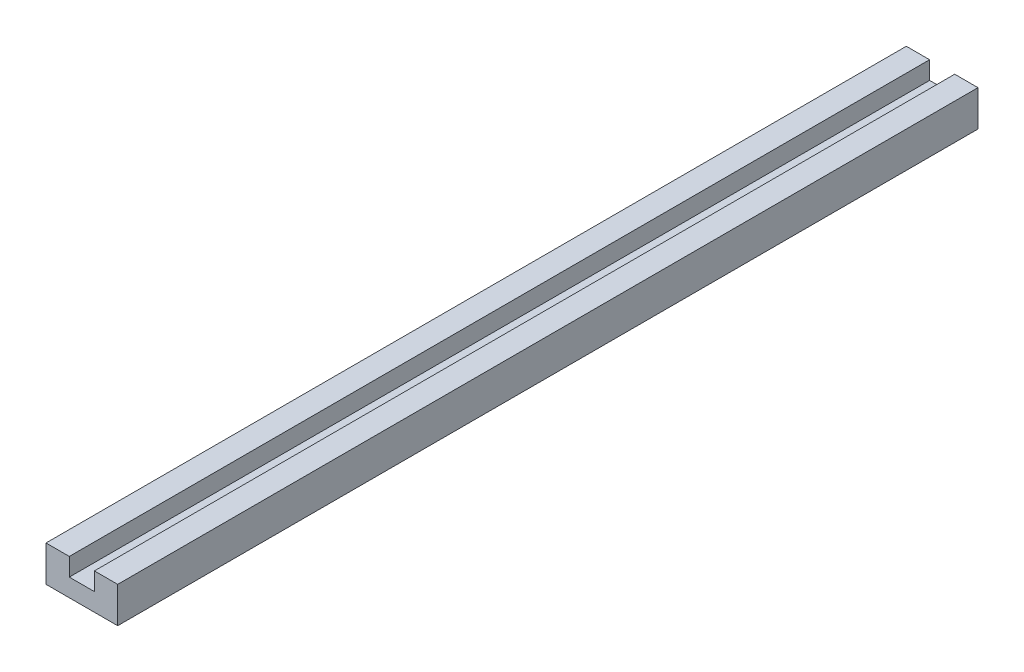
ISO-10303-21;
HEADER;
FILE_DESCRIPTION(('STEP AP214'),'2;1');
FILE_NAME('part.step','',(''),(''),'','','');
FILE_SCHEMA(('AUTOMOTIVE_DESIGN { 1 0 10303 214 1 1 1 1 }'));
ENDSEC;
DATA;
#1=APPLICATION_CONTEXT('core data for automotive mechanical design processes');
#2=APPLICATION_PROTOCOL_DEFINITION('international standard','automotive_design',2000,#1);
#3=PRODUCT_CONTEXT('',#1,'mechanical');
#4=PRODUCT('Part','Part','',(#3));
#5=PRODUCT_RELATED_PRODUCT_CATEGORY('part','',(#4));
#6=PRODUCT_DEFINITION_FORMATION('','',#4);
#7=PRODUCT_DEFINITION_CONTEXT('part definition',#1,'design');
#8=PRODUCT_DEFINITION('design','',#6,#7);
#9=PRODUCT_DEFINITION_SHAPE('','',#8);
#10=(LENGTH_UNIT() NAMED_UNIT(*) SI_UNIT(.MILLI.,.METRE.));
#11=(NAMED_UNIT(*) PLANE_ANGLE_UNIT() SI_UNIT($,.RADIAN.));
#12=(NAMED_UNIT(*) SI_UNIT($,.STERADIAN.) SOLID_ANGLE_UNIT());
#13=UNCERTAINTY_MEASURE_WITH_UNIT(LENGTH_MEASURE(1.E-05),#10,'distance_accuracy_value','');
#14=(GEOMETRIC_REPRESENTATION_CONTEXT(3) GLOBAL_UNCERTAINTY_ASSIGNED_CONTEXT((#13)) GLOBAL_UNIT_ASSIGNED_CONTEXT((#10,
#11,#12)) REPRESENTATION_CONTEXT('',''));
#15=CARTESIAN_POINT('',(0.,0.,0.));
#16=DIRECTION('',(0.,0.,1.));
#17=DIRECTION('',(1.,0.,0.));
#18=AXIS2_PLACEMENT_3D('',#15,#16,#17);
#19=CARTESIAN_POINT('',(0.,10.,240.));
#20=DIRECTION('',(0.,-1.,0.));
#21=DIRECTION('',(0.,0.,-1.));
#22=AXIS2_PLACEMENT_3D('',#19,#20,#21);
#23=PLANE('',#22);
#24=DIRECTION('',(0.,0.,1.));
#25=VECTOR('',#24,1.);
#26=CARTESIAN_POINT('',(13.5,10.,0.));
#27=LINE('',#26,#25);
#28=CARTESIAN_POINT('',(13.5,10.,0.));
#29=VERTEX_POINT('',#28);
#30=CARTESIAN_POINT('',(13.5,10.,240.));
#31=VERTEX_POINT('',#30);
#32=EDGE_CURVE('E108',#29,#31,#27,.T.);
#33=ORIENTED_EDGE('',*,*,#32,.T.);
#34=DIRECTION('',(-1.,0.,0.));
#35=VECTOR('',#34,1.);
#36=CARTESIAN_POINT('',(0.,10.,240.));
#37=LINE('',#36,#35);
#38=CARTESIAN_POINT('',(20.,10.,240.));
#39=VERTEX_POINT('',#38);
#40=EDGE_CURVE('E141',#39,#31,#37,.T.);
#41=ORIENTED_EDGE('',*,*,#40,.F.);
#42=DIRECTION('',(0.,0.,-1.));
#43=VECTOR('',#42,1.);
#44=CARTESIAN_POINT('',(20.,10.,240.));
#45=LINE('',#44,#43);
#46=CARTESIAN_POINT('',(20.,10.,0.));
#47=VERTEX_POINT('',#46);
#48=EDGE_CURVE('E131',#39,#47,#45,.T.);
#49=ORIENTED_EDGE('',*,*,#48,.T.);
#50=DIRECTION('',(-1.,0.,0.));
#51=VECTOR('',#50,1.);
#52=CARTESIAN_POINT('',(0.,10.,0.));
#53=LINE('',#52,#51);
#54=EDGE_CURVE('E124',#47,#29,#53,.T.);
#55=ORIENTED_EDGE('',*,*,#54,.T.);
#56=EDGE_LOOP('',(#33,#41,#49,#55));
#57=FACE_BOUND('',#56,.T.);
#58=ADVANCED_FACE('F33',(#57),#23,.F.);
#59=CARTESIAN_POINT('',(0.,0.,240.));
#60=DIRECTION('',(0.,0.,-1.));
#61=DIRECTION('',(-1.,0.,0.));
#62=AXIS2_PLACEMENT_3D('',#59,#60,#61);
#63=PLANE('',#62);
#64=DIRECTION('',(0.,-1.,0.));
#65=VECTOR('',#64,1.);
#66=CARTESIAN_POINT('',(13.5,0.,240.));
#67=LINE('',#66,#65);
#68=CARTESIAN_POINT('',(13.5,5.,240.));
#69=VERTEX_POINT('',#68);
#70=EDGE_CURVE('E113',#31,#69,#67,.T.);
#71=ORIENTED_EDGE('',*,*,#70,.T.);
#72=DIRECTION('',(1.,0.,0.));
#73=VECTOR('',#72,1.);
#74=CARTESIAN_POINT('',(0.,5.,240.));
#75=LINE('',#74,#73);
#76=CARTESIAN_POINT('',(6.5,5.,240.));
#77=VERTEX_POINT('',#76);
#78=EDGE_CURVE('E127',#77,#69,#75,.T.);
#79=ORIENTED_EDGE('',*,*,#78,.F.);
#80=DIRECTION('',(0.,-1.,0.));
#81=VECTOR('',#80,1.);
#82=CARTESIAN_POINT('',(6.5,0.,240.));
#83=LINE('',#82,#81);
#84=CARTESIAN_POINT('',(6.5,10.,240.));
#85=VERTEX_POINT('',#84);
#86=EDGE_CURVE('E163',#85,#77,#83,.T.);
#87=ORIENTED_EDGE('',*,*,#86,.F.);
#88=CARTESIAN_POINT('',(0.,10.,240.));
#89=VERTEX_POINT('',#88);
#90=EDGE_CURVE('E57',#85,#89,#37,.T.);
#91=ORIENTED_EDGE('',*,*,#90,.T.);
#92=DIRECTION('',(0.,-1.,0.));
#93=VECTOR('',#92,1.);
#94=CARTESIAN_POINT('',(0.,0.,240.));
#95=LINE('',#94,#93);
#96=CARTESIAN_POINT('',(0.,0.,240.));
#97=VERTEX_POINT('',#96);
#98=EDGE_CURVE('E132',#89,#97,#95,.T.);
#99=ORIENTED_EDGE('',*,*,#98,.T.);
#100=DIRECTION('',(1.,0.,0.));
#101=VECTOR('',#100,1.);
#102=CARTESIAN_POINT('',(0.,0.,240.));
#103=LINE('',#102,#101);
#104=CARTESIAN_POINT('',(20.,0.,240.));
#105=VERTEX_POINT('',#104);
#106=EDGE_CURVE('E86',#97,#105,#103,.T.);
#107=ORIENTED_EDGE('',*,*,#106,.T.);
#108=DIRECTION('',(0.,1.,0.));
#109=VECTOR('',#108,1.);
#110=CARTESIAN_POINT('',(20.,0.,240.));
#111=LINE('',#110,#109);
#112=EDGE_CURVE('E146',#105,#39,#111,.T.);
#113=ORIENTED_EDGE('',*,*,#112,.T.);
#114=ORIENTED_EDGE('',*,*,#40,.T.);
#115=EDGE_LOOP('',(#71,#79,#87,#91,#99,#107,#113,#114));
#116=FACE_BOUND('',#115,.T.);
#117=ADVANCED_FACE('F174',(#116),#63,.F.);
#118=CARTESIAN_POINT('',(0.,0.,0.));
#119=DIRECTION('',(0.,0.,-1.));
#120=DIRECTION('',(-1.,0.,0.));
#121=AXIS2_PLACEMENT_3D('',#118,#119,#120);
#122=PLANE('',#121);
#123=DIRECTION('',(1.,0.,0.));
#124=VECTOR('',#123,1.);
#125=CARTESIAN_POINT('',(0.,5.,0.));
#126=LINE('',#125,#124);
#127=CARTESIAN_POINT('',(6.5,5.,0.));
#128=VERTEX_POINT('',#127);
#129=CARTESIAN_POINT('',(13.5,5.,0.));
#130=VERTEX_POINT('',#129);
#131=EDGE_CURVE('E48',#128,#130,#126,.T.);
#132=ORIENTED_EDGE('',*,*,#131,.T.);
#133=DIRECTION('',(0.,-1.,0.));
#134=VECTOR('',#133,1.);
#135=CARTESIAN_POINT('',(13.5,0.,0.));
#136=LINE('',#135,#134);
#137=EDGE_CURVE('E111',#29,#130,#136,.T.);
#138=ORIENTED_EDGE('',*,*,#137,.F.);
#139=ORIENTED_EDGE('',*,*,#54,.F.);
#140=DIRECTION('',(0.,1.,0.));
#141=VECTOR('',#140,1.);
#142=CARTESIAN_POINT('',(20.,0.,0.));
#143=LINE('',#142,#141);
#144=CARTESIAN_POINT('',(20.,0.,0.));
#145=VERTEX_POINT('',#144);
#146=EDGE_CURVE('E135',#145,#47,#143,.T.);
#147=ORIENTED_EDGE('',*,*,#146,.F.);
#148=DIRECTION('',(1.,0.,0.));
#149=VECTOR('',#148,1.);
#150=CARTESIAN_POINT('',(0.,0.,0.));
#151=LINE('',#150,#149);
#152=CARTESIAN_POINT('',(0.,0.,0.));
#153=VERTEX_POINT('',#152);
#154=EDGE_CURVE('E148',#153,#145,#151,.T.);
#155=ORIENTED_EDGE('',*,*,#154,.F.);
#156=DIRECTION('',(0.,-1.,0.));
#157=VECTOR('',#156,1.);
#158=CARTESIAN_POINT('',(0.,0.,0.));
#159=LINE('',#158,#157);
#160=CARTESIAN_POINT('',(0.,10.,0.));
#161=VERTEX_POINT('',#160);
#162=EDGE_CURVE('E149',#161,#153,#159,.T.);
#163=ORIENTED_EDGE('',*,*,#162,.F.);
#164=CARTESIAN_POINT('',(6.5,10.,0.));
#165=VERTEX_POINT('',#164);
#166=EDGE_CURVE('E79',#165,#161,#53,.T.);
#167=ORIENTED_EDGE('',*,*,#166,.F.);
#168=DIRECTION('',(0.,-1.,0.));
#169=VECTOR('',#168,1.);
#170=CARTESIAN_POINT('',(6.5,0.,0.));
#171=LINE('',#170,#169);
#172=EDGE_CURVE('E126',#165,#128,#171,.T.);
#173=ORIENTED_EDGE('',*,*,#172,.T.);
#174=EDGE_LOOP('',(#132,#138,#139,#147,#155,#163,#167,#173));
#175=FACE_BOUND('',#174,.T.);
#176=ADVANCED_FACE('F122',(#175),#122,.T.);
#177=CARTESIAN_POINT('',(0.,0.,240.));
#178=DIRECTION('',(1.,0.,0.));
#179=DIRECTION('',(0.,1.,0.));
#180=AXIS2_PLACEMENT_3D('',#177,#178,#179);
#181=PLANE('',#180);
#182=ORIENTED_EDGE('',*,*,#162,.T.);
#183=DIRECTION('',(0.,0.,-1.));
#184=VECTOR('',#183,1.);
#185=CARTESIAN_POINT('',(0.,0.,240.));
#186=LINE('',#185,#184);
#187=EDGE_CURVE('E11',#97,#153,#186,.T.);
#188=ORIENTED_EDGE('',*,*,#187,.F.);
#189=ORIENTED_EDGE('',*,*,#98,.F.);
#190=DIRECTION('',(0.,0.,-1.));
#191=VECTOR('',#190,1.);
#192=CARTESIAN_POINT('',(0.,10.,240.));
#193=LINE('',#192,#191);
#194=EDGE_CURVE('E139',#89,#161,#193,.T.);
#195=ORIENTED_EDGE('',*,*,#194,.T.);
#196=EDGE_LOOP('',(#182,#188,#189,#195));
#197=FACE_BOUND('',#196,.T.);
#198=ADVANCED_FACE('F35',(#197),#181,.F.);
#199=CARTESIAN_POINT('',(0.,0.,240.));
#200=DIRECTION('',(0.,1.,0.));
#201=DIRECTION('',(0.,0.,1.));
#202=AXIS2_PLACEMENT_3D('',#199,#200,#201);
#203=PLANE('',#202);
#204=ORIENTED_EDGE('',*,*,#154,.T.);
#205=DIRECTION('',(0.,0.,-1.));
#206=VECTOR('',#205,1.);
#207=CARTESIAN_POINT('',(20.,0.,240.));
#208=LINE('',#207,#206);
#209=EDGE_CURVE('E41',#105,#145,#208,.T.);
#210=ORIENTED_EDGE('',*,*,#209,.F.);
#211=ORIENTED_EDGE('',*,*,#106,.F.);
#212=ORIENTED_EDGE('',*,*,#187,.T.);
#213=EDGE_LOOP('',(#204,#210,#211,#212));
#214=FACE_BOUND('',#213,.T.);
#215=ADVANCED_FACE('F197',(#214),#203,.F.);
#216=CARTESIAN_POINT('',(20.,0.,240.));
#217=DIRECTION('',(-1.,0.,0.));
#218=DIRECTION('',(0.,0.,1.));
#219=AXIS2_PLACEMENT_3D('',#216,#217,#218);
#220=PLANE('',#219);
#221=ORIENTED_EDGE('',*,*,#146,.T.);
#222=ORIENTED_EDGE('',*,*,#48,.F.);
#223=ORIENTED_EDGE('',*,*,#112,.F.);
#224=ORIENTED_EDGE('',*,*,#209,.T.);
#225=EDGE_LOOP('',(#221,#222,#223,#224));
#226=FACE_BOUND('',#225,.T.);
#227=ADVANCED_FACE('F145',(#226),#220,.F.);
#228=ORIENTED_EDGE('',*,*,#90,.F.);
#229=DIRECTION('',(0.,0.,1.));
#230=VECTOR('',#229,1.);
#231=CARTESIAN_POINT('',(6.5,10.,0.));
#232=LINE('',#231,#230);
#233=EDGE_CURVE('E118',#165,#85,#232,.T.);
#234=ORIENTED_EDGE('',*,*,#233,.F.);
#235=ORIENTED_EDGE('',*,*,#166,.T.);
#236=ORIENTED_EDGE('',*,*,#194,.F.);
#237=EDGE_LOOP('',(#228,#234,#235,#236));
#238=FACE_BOUND('',#237,.T.);
#239=ADVANCED_FACE('F170',(#238),#23,.F.);
#240=CARTESIAN_POINT('',(13.5,0.,0.));
#241=DIRECTION('',(-1.,0.,0.));
#242=DIRECTION('',(0.,0.,1.));
#243=AXIS2_PLACEMENT_3D('',#240,#241,#242);
#244=PLANE('',#243);
#245=ORIENTED_EDGE('',*,*,#70,.F.);
#246=ORIENTED_EDGE('',*,*,#32,.F.);
#247=ORIENTED_EDGE('',*,*,#137,.T.);
#248=DIRECTION('',(0.,0.,1.));
#249=VECTOR('',#248,1.);
#250=CARTESIAN_POINT('',(13.5,5.,0.));
#251=LINE('',#250,#249);
#252=EDGE_CURVE('E151',#130,#69,#251,.T.);
#253=ORIENTED_EDGE('',*,*,#252,.T.);
#254=EDGE_LOOP('',(#245,#246,#247,#253));
#255=FACE_BOUND('',#254,.T.);
#256=ADVANCED_FACE('F110',(#255),#244,.T.);
#257=CARTESIAN_POINT('',(0.,5.,0.));
#258=DIRECTION('',(0.,-1.,0.));
#259=DIRECTION('',(0.,0.,-1.));
#260=AXIS2_PLACEMENT_3D('',#257,#258,#259);
#261=PLANE('',#260);
#262=ORIENTED_EDGE('',*,*,#78,.T.);
#263=ORIENTED_EDGE('',*,*,#252,.F.);
#264=ORIENTED_EDGE('',*,*,#131,.F.);
#265=DIRECTION('',(0.,0.,1.));
#266=VECTOR('',#265,1.);
#267=CARTESIAN_POINT('',(6.5,5.,0.));
#268=LINE('',#267,#266);
#269=EDGE_CURVE('E158',#128,#77,#268,.T.);
#270=ORIENTED_EDGE('',*,*,#269,.T.);
#271=EDGE_LOOP('',(#262,#263,#264,#270));
#272=FACE_BOUND('',#271,.T.);
#273=ADVANCED_FACE('F176',(#272),#261,.F.);
#274=CARTESIAN_POINT('',(6.5,0.,0.));
#275=DIRECTION('',(-1.,0.,0.));
#276=DIRECTION('',(0.,-1.,0.));
#277=AXIS2_PLACEMENT_3D('',#274,#275,#276);
#278=PLANE('',#277);
#279=ORIENTED_EDGE('',*,*,#86,.T.);
#280=ORIENTED_EDGE('',*,*,#269,.F.);
#281=ORIENTED_EDGE('',*,*,#172,.F.);
#282=ORIENTED_EDGE('',*,*,#233,.T.);
#283=EDGE_LOOP('',(#279,#280,#281,#282));
#284=FACE_BOUND('',#283,.T.);
#285=ADVANCED_FACE('F169',(#284),#278,.F.);
#286=CLOSED_SHELL('',(#58,#117,#176,#198,#215,#227,#239,#256,#273,#285));
#287=MANIFOLD_SOLID_BREP('B2',#286);
#288=ADVANCED_BREP_SHAPE_REPRESENTATION('',(#18,#287),#14);
#289=SHAPE_DEFINITION_REPRESENTATION(#9,#288);
ENDSEC;
END-ISO-10303-21;
